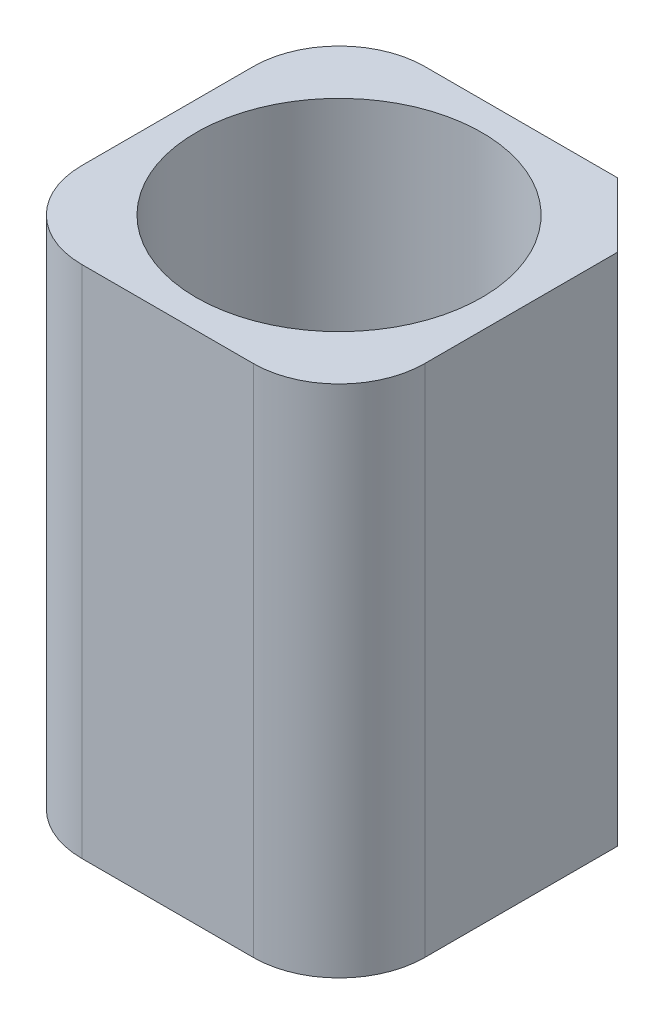
ISO-10303-21;
HEADER;
FILE_DESCRIPTION(('STEP AP214'),'2;1');
FILE_NAME('part.step','',(''),(''),'','','');
FILE_SCHEMA(('AUTOMOTIVE_DESIGN { 1 0 10303 214 1 1 1 1 }'));
ENDSEC;
DATA;
#1=APPLICATION_CONTEXT('core data for automotive mechanical design processes');
#2=APPLICATION_PROTOCOL_DEFINITION('international standard','automotive_design',2000,#1);
#3=PRODUCT_CONTEXT('',#1,'mechanical');
#4=PRODUCT('Part','Part','',(#3));
#5=PRODUCT_RELATED_PRODUCT_CATEGORY('part','',(#4));
#6=PRODUCT_DEFINITION_FORMATION('','',#4);
#7=PRODUCT_DEFINITION_CONTEXT('part definition',#1,'design');
#8=PRODUCT_DEFINITION('design','',#6,#7);
#9=PRODUCT_DEFINITION_SHAPE('','',#8);
#10=(LENGTH_UNIT() NAMED_UNIT(*) SI_UNIT(.MILLI.,.METRE.));
#11=(NAMED_UNIT(*) PLANE_ANGLE_UNIT() SI_UNIT($,.RADIAN.));
#12=(NAMED_UNIT(*) SI_UNIT($,.STERADIAN.) SOLID_ANGLE_UNIT());
#13=UNCERTAINTY_MEASURE_WITH_UNIT(LENGTH_MEASURE(1.E-05),#10,'distance_accuracy_value','');
#14=(GEOMETRIC_REPRESENTATION_CONTEXT(3) GLOBAL_UNCERTAINTY_ASSIGNED_CONTEXT((#13)) GLOBAL_UNIT_ASSIGNED_CONTEXT((#10,
#11,#12)) REPRESENTATION_CONTEXT('',''));
#15=CARTESIAN_POINT('',(0.,0.,0.));
#16=DIRECTION('',(0.,0.,1.));
#17=DIRECTION('',(1.,0.,0.));
#18=AXIS2_PLACEMENT_3D('',#15,#16,#17);
#19=CARTESIAN_POINT('',(1.5,4.5,1.5));
#20=DIRECTION('',(0.,-1.,0.));
#21=DIRECTION('',(0.,0.,-1.));
#22=AXIS2_PLACEMENT_3D('',#19,#20,#21);
#23=CYLINDRICAL_SURFACE('',#22,1.5);
#24=CARTESIAN_POINT('',(1.5,-4.5,1.5));
#25=DIRECTION('',(0.,1.,0.));
#26=DIRECTION('',(0.,0.,1.));
#27=AXIS2_PLACEMENT_3D('',#24,#25,#26);
#28=CIRCLE('',#27,1.5);
#29=CARTESIAN_POINT('',(1.5,-4.5,3.));
#30=VERTEX_POINT('',#29);
#31=CARTESIAN_POINT('',(3.,-4.5,1.5));
#32=VERTEX_POINT('',#31);
#33=EDGE_CURVE('E353',#30,#32,#28,.T.);
#34=ORIENTED_EDGE('',*,*,#33,.T.);
#35=DIRECTION('',(0.,-1.,0.));
#36=VECTOR('',#35,1.);
#37=CARTESIAN_POINT('',(3.,4.5,1.5));
#38=LINE('',#37,#36);
#39=CARTESIAN_POINT('',(3.,4.5,1.5));
#40=VERTEX_POINT('',#39);
#41=EDGE_CURVE('E11',#40,#32,#38,.T.);
#42=ORIENTED_EDGE('',*,*,#41,.F.);
#43=CARTESIAN_POINT('',(1.5,4.5,1.5));
#44=DIRECTION('',(0.,1.,0.));
#45=DIRECTION('',(0.,0.,1.));
#46=AXIS2_PLACEMENT_3D('',#43,#44,#45);
#47=CIRCLE('',#46,1.5);
#48=CARTESIAN_POINT('',(1.5,4.5,3.));
#49=VERTEX_POINT('',#48);
#50=EDGE_CURVE('E320',#49,#40,#47,.T.);
#51=ORIENTED_EDGE('',*,*,#50,.F.);
#52=DIRECTION('',(0.,-1.,0.));
#53=VECTOR('',#52,1.);
#54=CARTESIAN_POINT('',(1.5,4.5,3.));
#55=LINE('',#54,#53);
#56=EDGE_CURVE('E349',#49,#30,#55,.T.);
#57=ORIENTED_EDGE('',*,*,#56,.T.);
#58=EDGE_LOOP('',(#34,#42,#51,#57));
#59=FACE_BOUND('',#58,.T.);
#60=ADVANCED_FACE('F41',(#59),#23,.T.);
#61=CARTESIAN_POINT('',(3.,4.5,0.));
#62=DIRECTION('',(-1.,0.,0.));
#63=DIRECTION('',(0.,0.,1.));
#64=AXIS2_PLACEMENT_3D('',#61,#62,#63);
#65=PLANE('',#64);
#66=DIRECTION('',(0.,0.,-1.));
#67=VECTOR('',#66,1.);
#68=CARTESIAN_POINT('',(3.,-4.5,0.));
#69=LINE('',#68,#67);
#70=CARTESIAN_POINT('',(3.,-4.5,-1.875));
#71=VERTEX_POINT('',#70);
#72=EDGE_CURVE('E357',#32,#71,#69,.T.);
#73=ORIENTED_EDGE('',*,*,#72,.T.);
#74=DIRECTION('',(0.,-1.,0.));
#75=VECTOR('',#74,1.);
#76=CARTESIAN_POINT('',(3.,4.5,-1.875));
#77=LINE('',#76,#75);
#78=CARTESIAN_POINT('',(3.,4.5,-1.875));
#79=VERTEX_POINT('',#78);
#80=EDGE_CURVE('E50',#79,#71,#77,.T.);
#81=ORIENTED_EDGE('',*,*,#80,.F.);
#82=DIRECTION('',(0.,0.,-1.));
#83=VECTOR('',#82,1.);
#84=CARTESIAN_POINT('',(3.,4.5,0.));
#85=LINE('',#84,#83);
#86=EDGE_CURVE('E325',#40,#79,#85,.T.);
#87=ORIENTED_EDGE('',*,*,#86,.F.);
#88=ORIENTED_EDGE('',*,*,#41,.T.);
#89=EDGE_LOOP('',(#73,#81,#87,#88));
#90=FACE_BOUND('',#89,.T.);
#91=ADVANCED_FACE('F407',(#90),#65,.F.);
#92=CARTESIAN_POINT('',(2.4375,4.5,-2.4375));
#93=DIRECTION('',(0.707106781186547,0.,-0.707106781186547));
#94=DIRECTION('',(-0.707106781186548,0.,-0.707106781186548));
#95=AXIS2_PLACEMENT_3D('',#92,#93,#94);
#96=PLANE('',#95);
#97=DIRECTION('',(0.707106781186548,0.,0.707106781186548));
#98=VECTOR('',#97,1.);
#99=CARTESIAN_POINT('',(2.4375,-4.5,-2.4375));
#100=LINE('',#99,#98);
#101=CARTESIAN_POINT('',(1.875,-4.5,-3.));
#102=VERTEX_POINT('',#101);
#103=EDGE_CURVE('E361',#102,#71,#100,.T.);
#104=ORIENTED_EDGE('',*,*,#103,.F.);
#105=DIRECTION('',(0.,-1.,0.));
#106=VECTOR('',#105,1.);
#107=CARTESIAN_POINT('',(1.875,4.5,-3.));
#108=LINE('',#107,#106);
#109=CARTESIAN_POINT('',(1.875,4.5,-3.));
#110=VERTEX_POINT('',#109);
#111=EDGE_CURVE('E398',#110,#102,#108,.T.);
#112=ORIENTED_EDGE('',*,*,#111,.F.);
#113=DIRECTION('',(0.707106781186548,0.,0.707106781186548));
#114=VECTOR('',#113,1.);
#115=CARTESIAN_POINT('',(2.4375,4.5,-2.4375));
#116=LINE('',#115,#114);
#117=EDGE_CURVE('E328',#110,#79,#116,.T.);
#118=ORIENTED_EDGE('',*,*,#117,.T.);
#119=ORIENTED_EDGE('',*,*,#80,.T.);
#120=EDGE_LOOP('',(#104,#112,#118,#119));
#121=FACE_BOUND('',#120,.T.);
#122=ADVANCED_FACE('F404',(#121),#96,.T.);
#123=CARTESIAN_POINT('',(0.,4.5,-3.));
#124=DIRECTION('',(0.,0.,-1.));
#125=DIRECTION('',(-1.,0.,0.));
#126=AXIS2_PLACEMENT_3D('',#123,#124,#125);
#127=PLANE('',#126);
#128=DIRECTION('',(1.,0.,0.));
#129=VECTOR('',#128,1.);
#130=CARTESIAN_POINT('',(0.,-4.5,-3.));
#131=LINE('',#130,#129);
#132=CARTESIAN_POINT('',(-1.5,-4.5,-3.));
#133=VERTEX_POINT('',#132);
#134=EDGE_CURVE('E365',#133,#102,#131,.T.);
#135=ORIENTED_EDGE('',*,*,#134,.F.);
#136=DIRECTION('',(0.,-1.,0.));
#137=VECTOR('',#136,1.);
#138=CARTESIAN_POINT('',(-1.5,4.5,-3.));
#139=LINE('',#138,#137);
#140=CARTESIAN_POINT('',(-1.5,4.5,-3.));
#141=VERTEX_POINT('',#140);
#142=EDGE_CURVE('E395',#141,#133,#139,.T.);
#143=ORIENTED_EDGE('',*,*,#142,.F.);
#144=DIRECTION('',(1.,0.,0.));
#145=VECTOR('',#144,1.);
#146=CARTESIAN_POINT('',(0.,4.5,-3.));
#147=LINE('',#146,#145);
#148=EDGE_CURVE('E332',#141,#110,#147,.T.);
#149=ORIENTED_EDGE('',*,*,#148,.T.);
#150=ORIENTED_EDGE('',*,*,#111,.T.);
#151=EDGE_LOOP('',(#135,#143,#149,#150));
#152=FACE_BOUND('',#151,.T.);
#153=ADVANCED_FACE('F415',(#152),#127,.T.);
#154=CARTESIAN_POINT('',(-1.5,4.5,-1.5));
#155=DIRECTION('',(0.,-1.,0.));
#156=DIRECTION('',(0.,0.,-1.));
#157=AXIS2_PLACEMENT_3D('',#154,#155,#156);
#158=CYLINDRICAL_SURFACE('',#157,1.5);
#159=CARTESIAN_POINT('',(-1.5,-4.5,-1.5));
#160=DIRECTION('',(0.,1.,0.));
#161=DIRECTION('',(0.,0.,1.));
#162=AXIS2_PLACEMENT_3D('',#159,#160,#161);
#163=CIRCLE('',#162,1.5);
#164=CARTESIAN_POINT('',(-3.,-4.5,-1.5));
#165=VERTEX_POINT('',#164);
#166=EDGE_CURVE('E369',#133,#165,#163,.T.);
#167=ORIENTED_EDGE('',*,*,#166,.T.);
#168=DIRECTION('',(0.,-1.,0.));
#169=VECTOR('',#168,1.);
#170=CARTESIAN_POINT('',(-3.,4.5,-1.5));
#171=LINE('',#170,#169);
#172=CARTESIAN_POINT('',(-3.,4.5,-1.5));
#173=VERTEX_POINT('',#172);
#174=EDGE_CURVE('E392',#173,#165,#171,.T.);
#175=ORIENTED_EDGE('',*,*,#174,.F.);
#176=CARTESIAN_POINT('',(-1.5,4.5,-1.5));
#177=DIRECTION('',(0.,1.,0.));
#178=DIRECTION('',(0.,0.,1.));
#179=AXIS2_PLACEMENT_3D('',#176,#177,#178);
#180=CIRCLE('',#179,1.5);
#181=EDGE_CURVE('E336',#141,#173,#180,.T.);
#182=ORIENTED_EDGE('',*,*,#181,.F.);
#183=ORIENTED_EDGE('',*,*,#142,.T.);
#184=EDGE_LOOP('',(#167,#175,#182,#183));
#185=FACE_BOUND('',#184,.T.);
#186=ADVANCED_FACE('F438',(#185),#158,.T.);
#187=CARTESIAN_POINT('',(-3.,4.5,0.));
#188=DIRECTION('',(-1.,0.,0.));
#189=DIRECTION('',(0.,0.,1.));
#190=AXIS2_PLACEMENT_3D('',#187,#188,#189);
#191=PLANE('',#190);
#192=DIRECTION('',(0.,0.,-1.));
#193=VECTOR('',#192,1.);
#194=CARTESIAN_POINT('',(-3.,-4.5,0.));
#195=LINE('',#194,#193);
#196=CARTESIAN_POINT('',(-3.,-4.5,1.5));
#197=VERTEX_POINT('',#196);
#198=EDGE_CURVE('E373',#197,#165,#195,.T.);
#199=ORIENTED_EDGE('',*,*,#198,.F.);
#200=DIRECTION('',(0.,-1.,0.));
#201=VECTOR('',#200,1.);
#202=CARTESIAN_POINT('',(-3.,4.5,1.5));
#203=LINE('',#202,#201);
#204=CARTESIAN_POINT('',(-3.,4.5,1.5));
#205=VERTEX_POINT('',#204);
#206=EDGE_CURVE('E389',#205,#197,#203,.T.);
#207=ORIENTED_EDGE('',*,*,#206,.F.);
#208=DIRECTION('',(0.,0.,-1.));
#209=VECTOR('',#208,1.);
#210=CARTESIAN_POINT('',(-3.,4.5,0.));
#211=LINE('',#210,#209);
#212=EDGE_CURVE('E339',#205,#173,#211,.T.);
#213=ORIENTED_EDGE('',*,*,#212,.T.);
#214=ORIENTED_EDGE('',*,*,#174,.T.);
#215=EDGE_LOOP('',(#199,#207,#213,#214));
#216=FACE_BOUND('',#215,.T.);
#217=ADVANCED_FACE('F435',(#216),#191,.T.);
#218=CARTESIAN_POINT('',(-1.5,4.5,1.5));
#219=DIRECTION('',(0.,-1.,0.));
#220=DIRECTION('',(0.,0.,-1.));
#221=AXIS2_PLACEMENT_3D('',#218,#219,#220);
#222=CYLINDRICAL_SURFACE('',#221,1.5);
#223=CARTESIAN_POINT('',(-1.5,-4.5,1.5));
#224=DIRECTION('',(0.,1.,0.));
#225=DIRECTION('',(0.,0.,1.));
#226=AXIS2_PLACEMENT_3D('',#223,#224,#225);
#227=CIRCLE('',#226,1.5);
#228=CARTESIAN_POINT('',(-1.5,-4.5,3.));
#229=VERTEX_POINT('',#228);
#230=EDGE_CURVE('E377',#197,#229,#227,.T.);
#231=ORIENTED_EDGE('',*,*,#230,.T.);
#232=DIRECTION('',(0.,-1.,0.));
#233=VECTOR('',#232,1.);
#234=CARTESIAN_POINT('',(-1.5,4.5,3.));
#235=LINE('',#234,#233);
#236=CARTESIAN_POINT('',(-1.5,4.5,3.));
#237=VERTEX_POINT('',#236);
#238=EDGE_CURVE('E385',#237,#229,#235,.T.);
#239=ORIENTED_EDGE('',*,*,#238,.F.);
#240=CARTESIAN_POINT('',(-1.5,4.5,1.5));
#241=DIRECTION('',(0.,1.,0.));
#242=DIRECTION('',(0.,0.,1.));
#243=AXIS2_PLACEMENT_3D('',#240,#241,#242);
#244=CIRCLE('',#243,1.5);
#245=EDGE_CURVE('E343',#205,#237,#244,.T.);
#246=ORIENTED_EDGE('',*,*,#245,.F.);
#247=ORIENTED_EDGE('',*,*,#206,.T.);
#248=EDGE_LOOP('',(#231,#239,#246,#247));
#249=FACE_BOUND('',#248,.T.);
#250=ADVANCED_FACE('F432',(#249),#222,.T.);
#251=CARTESIAN_POINT('',(0.,4.5,0.));
#252=DIRECTION('',(0.,-1.,0.));
#253=DIRECTION('',(0.,0.,-1.));
#254=AXIS2_PLACEMENT_3D('',#251,#252,#253);
#255=CYLINDRICAL_SURFACE('',#254,2.5);
#256=CARTESIAN_POINT('',(0.,4.5,0.));
#257=DIRECTION('',(0.,1.,0.));
#258=DIRECTION('',(0.,0.,1.));
#259=AXIS2_PLACEMENT_3D('',#256,#257,#258);
#260=CIRCLE('',#259,2.5);
#261=CARTESIAN_POINT('',(0.,4.5,2.5));
#262=VERTEX_POINT('',#261);
#263=EDGE_CURVE('E316',#262,#262,#260,.T.);
#264=ORIENTED_EDGE('',*,*,#263,.T.);
#265=EDGE_LOOP('',(#264));
#266=FACE_BOUND('',#265,.T.);
#267=CARTESIAN_POINT('',(0.,-4.5,0.));
#268=DIRECTION('',(0.,1.,0.));
#269=DIRECTION('',(0.,0.,1.));
#270=AXIS2_PLACEMENT_3D('',#267,#268,#269);
#271=CIRCLE('',#270,2.5);
#272=CARTESIAN_POINT('',(0.,-4.5,2.5));
#273=VERTEX_POINT('',#272);
#274=EDGE_CURVE('E225',#273,#273,#271,.T.);
#275=ORIENTED_EDGE('',*,*,#274,.F.);
#276=EDGE_LOOP('',(#275));
#277=FACE_BOUND('',#276,.T.);
#278=ADVANCED_FACE('F43',(#266,#277),#255,.F.);
#279=CARTESIAN_POINT('',(0.,4.5,3.));
#280=DIRECTION('',(0.,0.,-1.));
#281=DIRECTION('',(-1.,0.,0.));
#282=AXIS2_PLACEMENT_3D('',#279,#280,#281);
#283=PLANE('',#282);
#284=DIRECTION('',(1.,0.,0.));
#285=VECTOR('',#284,1.);
#286=CARTESIAN_POINT('',(0.,-4.5,3.));
#287=LINE('',#286,#285);
#288=EDGE_CURVE('E321',#229,#30,#287,.T.);
#289=ORIENTED_EDGE('',*,*,#288,.T.);
#290=ORIENTED_EDGE('',*,*,#56,.F.);
#291=DIRECTION('',(1.,0.,0.));
#292=VECTOR('',#291,1.);
#293=CARTESIAN_POINT('',(0.,4.5,3.));
#294=LINE('',#293,#292);
#295=EDGE_CURVE('E346',#237,#49,#294,.T.);
#296=ORIENTED_EDGE('',*,*,#295,.F.);
#297=ORIENTED_EDGE('',*,*,#238,.T.);
#298=EDGE_LOOP('',(#289,#290,#296,#297));
#299=FACE_BOUND('',#298,.T.);
#300=ADVANCED_FACE('F428',(#299),#283,.F.);
#301=CARTESIAN_POINT('',(0.,4.5,0.));
#302=DIRECTION('',(0.,1.,0.));
#303=DIRECTION('',(0.,0.,1.));
#304=AXIS2_PLACEMENT_3D('',#301,#302,#303);
#305=PLANE('',#304);
#306=ORIENTED_EDGE('',*,*,#263,.F.);
#307=EDGE_LOOP('',(#306));
#308=FACE_BOUND('',#307,.T.);
#309=ORIENTED_EDGE('',*,*,#50,.T.);
#310=ORIENTED_EDGE('',*,*,#86,.T.);
#311=ORIENTED_EDGE('',*,*,#117,.F.);
#312=ORIENTED_EDGE('',*,*,#148,.F.);
#313=ORIENTED_EDGE('',*,*,#181,.T.);
#314=ORIENTED_EDGE('',*,*,#212,.F.);
#315=ORIENTED_EDGE('',*,*,#245,.T.);
#316=ORIENTED_EDGE('',*,*,#295,.T.);
#317=EDGE_LOOP('',(#309,#310,#311,#312,#313,#314,#315,#316));
#318=FACE_BOUND('',#317,.T.);
#319=ADVANCED_FACE('F419',(#308,#318),#305,.T.);
#320=CARTESIAN_POINT('',(0.,-4.5,0.));
#321=DIRECTION('',(0.,1.,0.));
#322=DIRECTION('',(0.,0.,1.));
#323=AXIS2_PLACEMENT_3D('',#320,#321,#322);
#324=PLANE('',#323);
#325=DIRECTION('',(-1.,0.,0.));
#326=VECTOR('',#325,1.);
#327=CARTESIAN_POINT('',(-2.5,-4.5,1.75));
#328=LINE('',#327,#326);
#329=CARTESIAN_POINT('',(-2.225,-4.5,1.75));
#330=VERTEX_POINT('',#329);
#331=CARTESIAN_POINT('',(-2.5,-4.5,1.75));
#332=VERTEX_POINT('',#331);
#333=EDGE_CURVE('E215',#330,#332,#328,.T.);
#334=ORIENTED_EDGE('',*,*,#333,.F.);
#335=DIRECTION('',(0.,0.,1.));
#336=VECTOR('',#335,1.);
#337=CARTESIAN_POINT('',(-2.225,-4.5,1.75));
#338=LINE('',#337,#336);
#339=CARTESIAN_POINT('',(-2.225,-4.5,1.475));
#340=VERTEX_POINT('',#339);
#341=EDGE_CURVE('E57',#340,#330,#338,.T.);
#342=ORIENTED_EDGE('',*,*,#341,.F.);
#343=DIRECTION('',(1.,0.,0.));
#344=VECTOR('',#343,1.);
#345=CARTESIAN_POINT('',(-2.5,-4.5,1.475));
#346=LINE('',#345,#344);
#347=CARTESIAN_POINT('',(-2.5,-4.5,1.475));
#348=VERTEX_POINT('',#347);
#349=EDGE_CURVE('E202',#348,#340,#346,.T.);
#350=ORIENTED_EDGE('',*,*,#349,.F.);
#351=DIRECTION('',(0.,0.,-1.));
#352=VECTOR('',#351,1.);
#353=CARTESIAN_POINT('',(-2.5,-4.5,1.75));
#354=LINE('',#353,#352);
#355=EDGE_CURVE('E206',#332,#348,#354,.T.);
#356=ORIENTED_EDGE('',*,*,#355,.F.);
#357=EDGE_LOOP('',(#334,#342,#350,#356));
#358=FACE_BOUND('',#357,.T.);
#359=DIRECTION('',(-1.,0.,0.));
#360=VECTOR('',#359,1.);
#361=CARTESIAN_POINT('',(-2.25,-4.5,-2.225));
#362=LINE('',#361,#360);
#363=CARTESIAN_POINT('',(-1.975,-4.5,-2.225));
#364=VERTEX_POINT('',#363);
#365=CARTESIAN_POINT('',(-2.25,-4.5,-2.225));
#366=VERTEX_POINT('',#365);
#367=EDGE_CURVE('E251',#364,#366,#362,.T.);
#368=ORIENTED_EDGE('',*,*,#367,.F.);
#369=DIRECTION('',(0.,0.,1.));
#370=VECTOR('',#369,1.);
#371=CARTESIAN_POINT('',(-1.975,-4.5,-2.225));
#372=LINE('',#371,#370);
#373=CARTESIAN_POINT('',(-1.975,-4.5,-2.5));
#374=VERTEX_POINT('',#373);
#375=EDGE_CURVE('E65',#374,#364,#372,.T.);
#376=ORIENTED_EDGE('',*,*,#375,.F.);
#377=DIRECTION('',(1.,0.,0.));
#378=VECTOR('',#377,1.);
#379=CARTESIAN_POINT('',(-2.25,-4.5,-2.5));
#380=LINE('',#379,#378);
#381=CARTESIAN_POINT('',(-2.25,-4.5,-2.5));
#382=VERTEX_POINT('',#381);
#383=EDGE_CURVE('E236',#382,#374,#380,.T.);
#384=ORIENTED_EDGE('',*,*,#383,.F.);
#385=DIRECTION('',(0.,0.,-1.));
#386=VECTOR('',#385,1.);
#387=CARTESIAN_POINT('',(-2.25,-4.5,-2.225));
#388=LINE('',#387,#386);
#389=EDGE_CURVE('E256',#366,#382,#388,.T.);
#390=ORIENTED_EDGE('',*,*,#389,.F.);
#391=EDGE_LOOP('',(#368,#376,#384,#390));
#392=FACE_BOUND('',#391,.T.);
#393=DIRECTION('',(-1.,0.,0.));
#394=VECTOR('',#393,1.);
#395=CARTESIAN_POINT('',(1.98,-4.5,-2.225));
#396=LINE('',#395,#394);
#397=CARTESIAN_POINT('',(1.98,-4.5,-2.225));
#398=VERTEX_POINT('',#397);
#399=CARTESIAN_POINT('',(1.705,-4.5,-2.225));
#400=VERTEX_POINT('',#399);
#401=EDGE_CURVE('E294',#398,#400,#396,.T.);
#402=ORIENTED_EDGE('',*,*,#401,.F.);
#403=DIRECTION('',(0.,0.,1.));
#404=VECTOR('',#403,1.);
#405=CARTESIAN_POINT('',(1.98,-4.5,-2.5));
#406=LINE('',#405,#404);
#407=CARTESIAN_POINT('',(1.98,-4.5,-2.5));
#408=VERTEX_POINT('',#407);
#409=EDGE_CURVE('E291',#408,#398,#406,.T.);
#410=ORIENTED_EDGE('',*,*,#409,.F.);
#411=DIRECTION('',(1.,0.,0.));
#412=VECTOR('',#411,1.);
#413=CARTESIAN_POINT('',(1.98,-4.5,-2.5));
#414=LINE('',#413,#412);
#415=CARTESIAN_POINT('',(1.705,-4.5,-2.5));
#416=VERTEX_POINT('',#415);
#417=EDGE_CURVE('E278',#416,#408,#414,.T.);
#418=ORIENTED_EDGE('',*,*,#417,.F.);
#419=DIRECTION('',(0.,0.,-1.));
#420=VECTOR('',#419,1.);
#421=CARTESIAN_POINT('',(1.705,-4.5,-2.5));
#422=LINE('',#421,#420);
#423=EDGE_CURVE('E298',#400,#416,#422,.T.);
#424=ORIENTED_EDGE('',*,*,#423,.F.);
#425=EDGE_LOOP('',(#402,#410,#418,#424));
#426=FACE_BOUND('',#425,.T.);
#427=ORIENTED_EDGE('',*,*,#274,.T.);
#428=EDGE_LOOP('',(#427));
#429=FACE_BOUND('',#428,.T.);
#430=ORIENTED_EDGE('',*,*,#33,.F.);
#431=ORIENTED_EDGE('',*,*,#288,.F.);
#432=ORIENTED_EDGE('',*,*,#230,.F.);
#433=ORIENTED_EDGE('',*,*,#198,.T.);
#434=ORIENTED_EDGE('',*,*,#166,.F.);
#435=ORIENTED_EDGE('',*,*,#134,.T.);
#436=ORIENTED_EDGE('',*,*,#103,.T.);
#437=ORIENTED_EDGE('',*,*,#72,.F.);
#438=EDGE_LOOP('',(#430,#431,#432,#433,#434,#435,#436,#437));
#439=FACE_BOUND('',#438,.T.);
#440=ADVANCED_FACE('F411',(#358,#392,#426,#429,#439),#324,.F.);
#441=CARTESIAN_POINT('',(1.98,-3.5,-2.5));
#442=DIRECTION('',(1.,0.,0.));
#443=DIRECTION('',(0.,0.,-1.));
#444=AXIS2_PLACEMENT_3D('',#441,#442,#443);
#445=PLANE('',#444);
#446=ORIENTED_EDGE('',*,*,#409,.T.);
#447=DIRECTION('',(0.,-1.,0.));
#448=VECTOR('',#447,1.);
#449=CARTESIAN_POINT('',(1.98,-3.5,-2.225));
#450=LINE('',#449,#448);
#451=CARTESIAN_POINT('',(1.98,-3.5,-2.225));
#452=VERTEX_POINT('',#451);
#453=EDGE_CURVE('E290',#452,#398,#450,.T.);
#454=ORIENTED_EDGE('',*,*,#453,.F.);
#455=DIRECTION('',(0.,0.,1.));
#456=VECTOR('',#455,1.);
#457=CARTESIAN_POINT('',(1.98,-3.5,-2.5));
#458=LINE('',#457,#456);
#459=CARTESIAN_POINT('',(1.98,-3.5,-2.5));
#460=VERTEX_POINT('',#459);
#461=EDGE_CURVE('E273',#460,#452,#458,.T.);
#462=ORIENTED_EDGE('',*,*,#461,.F.);
#463=DIRECTION('',(0.,-1.,0.));
#464=VECTOR('',#463,1.);
#465=CARTESIAN_POINT('',(1.98,-3.5,-2.5));
#466=LINE('',#465,#464);
#467=EDGE_CURVE('E252',#460,#408,#466,.T.);
#468=ORIENTED_EDGE('',*,*,#467,.T.);
#469=EDGE_LOOP('',(#446,#454,#462,#468));
#470=FACE_BOUND('',#469,.T.);
#471=ADVANCED_FACE('F517',(#470),#445,.F.);
#472=CARTESIAN_POINT('',(1.98,-3.5,-2.5));
#473=DIRECTION('',(0.,0.,-1.));
#474=DIRECTION('',(-1.,0.,0.));
#475=AXIS2_PLACEMENT_3D('',#472,#473,#474);
#476=PLANE('',#475);
#477=ORIENTED_EDGE('',*,*,#417,.T.);
#478=ORIENTED_EDGE('',*,*,#467,.F.);
#479=DIRECTION('',(1.,0.,0.));
#480=VECTOR('',#479,1.);
#481=CARTESIAN_POINT('',(1.98,-3.5,-2.5));
#482=LINE('',#481,#480);
#483=CARTESIAN_POINT('',(1.705,-3.5,-2.5));
#484=VERTEX_POINT('',#483);
#485=EDGE_CURVE('E286',#484,#460,#482,.T.);
#486=ORIENTED_EDGE('',*,*,#485,.F.);
#487=DIRECTION('',(0.,-1.,0.));
#488=VECTOR('',#487,1.);
#489=CARTESIAN_POINT('',(1.705,-3.5,-2.5));
#490=LINE('',#489,#488);
#491=EDGE_CURVE('E307',#484,#416,#490,.T.);
#492=ORIENTED_EDGE('',*,*,#491,.T.);
#493=EDGE_LOOP('',(#477,#478,#486,#492));
#494=FACE_BOUND('',#493,.T.);
#495=ADVANCED_FACE('F528',(#494),#476,.F.);
#496=CARTESIAN_POINT('',(1.705,-3.5,-2.5));
#497=DIRECTION('',(-1.,0.,0.));
#498=DIRECTION('',(0.,0.,1.));
#499=AXIS2_PLACEMENT_3D('',#496,#497,#498);
#500=PLANE('',#499);
#501=ORIENTED_EDGE('',*,*,#423,.T.);
#502=ORIENTED_EDGE('',*,*,#491,.F.);
#503=DIRECTION('',(0.,0.,-1.));
#504=VECTOR('',#503,1.);
#505=CARTESIAN_POINT('',(1.705,-3.5,-2.5));
#506=LINE('',#505,#504);
#507=CARTESIAN_POINT('',(1.705,-3.5,-2.225));
#508=VERTEX_POINT('',#507);
#509=EDGE_CURVE('E282',#508,#484,#506,.T.);
#510=ORIENTED_EDGE('',*,*,#509,.F.);
#511=DIRECTION('',(0.,-1.,0.));
#512=VECTOR('',#511,1.);
#513=CARTESIAN_POINT('',(1.705,-3.5,-2.225));
#514=LINE('',#513,#512);
#515=EDGE_CURVE('E310',#508,#400,#514,.T.);
#516=ORIENTED_EDGE('',*,*,#515,.T.);
#517=EDGE_LOOP('',(#501,#502,#510,#516));
#518=FACE_BOUND('',#517,.T.);
#519=ADVANCED_FACE('F538',(#518),#500,.F.);
#520=CARTESIAN_POINT('',(1.98,-3.5,-2.225));
#521=DIRECTION('',(0.,0.,1.));
#522=DIRECTION('',(1.,0.,0.));
#523=AXIS2_PLACEMENT_3D('',#520,#521,#522);
#524=PLANE('',#523);
#525=ORIENTED_EDGE('',*,*,#401,.T.);
#526=ORIENTED_EDGE('',*,*,#515,.F.);
#527=DIRECTION('',(-1.,0.,0.));
#528=VECTOR('',#527,1.);
#529=CARTESIAN_POINT('',(1.98,-3.5,-2.225));
#530=LINE('',#529,#528);
#531=EDGE_CURVE('E277',#452,#508,#530,.T.);
#532=ORIENTED_EDGE('',*,*,#531,.F.);
#533=ORIENTED_EDGE('',*,*,#453,.T.);
#534=EDGE_LOOP('',(#525,#526,#532,#533));
#535=FACE_BOUND('',#534,.T.);
#536=ADVANCED_FACE('F548',(#535),#524,.F.);
#537=CARTESIAN_POINT('',(0.,-3.5,0.));
#538=DIRECTION('',(0.,-1.,0.));
#539=DIRECTION('',(0.,0.,-1.));
#540=AXIS2_PLACEMENT_3D('',#537,#538,#539);
#541=PLANE('',#540);
#542=ORIENTED_EDGE('',*,*,#461,.T.);
#543=ORIENTED_EDGE('',*,*,#531,.T.);
#544=ORIENTED_EDGE('',*,*,#509,.T.);
#545=ORIENTED_EDGE('',*,*,#485,.T.);
#546=EDGE_LOOP('',(#542,#543,#544,#545));
#547=FACE_BOUND('',#546,.T.);
#548=ADVANCED_FACE('F558',(#547),#541,.T.);
#549=CARTESIAN_POINT('',(-1.975,-3.5,-2.225));
#550=DIRECTION('',(1.,0.,0.));
#551=DIRECTION('',(0.,0.,-1.));
#552=AXIS2_PLACEMENT_3D('',#549,#550,#551);
#553=PLANE('',#552);
#554=ORIENTED_EDGE('',*,*,#375,.T.);
#555=DIRECTION('',(0.,-1.,0.));
#556=VECTOR('',#555,1.);
#557=CARTESIAN_POINT('',(-1.975,-3.5,-2.225));
#558=LINE('',#557,#556);
#559=CARTESIAN_POINT('',(-1.975,-3.5,-2.225));
#560=VERTEX_POINT('',#559);
#561=EDGE_CURVE('E248',#560,#364,#558,.T.);
#562=ORIENTED_EDGE('',*,*,#561,.F.);
#563=DIRECTION('',(0.,0.,1.));
#564=VECTOR('',#563,1.);
#565=CARTESIAN_POINT('',(-1.975,-3.5,-2.225));
#566=LINE('',#565,#564);
#567=CARTESIAN_POINT('',(-1.975,-3.5,-2.5));
#568=VERTEX_POINT('',#567);
#569=EDGE_CURVE('E231',#568,#560,#566,.T.);
#570=ORIENTED_EDGE('',*,*,#569,.F.);
#571=DIRECTION('',(0.,-1.,0.));
#572=VECTOR('',#571,1.);
#573=CARTESIAN_POINT('',(-1.975,-3.5,-2.5));
#574=LINE('',#573,#572);
#575=EDGE_CURVE('E216',#568,#374,#574,.T.);
#576=ORIENTED_EDGE('',*,*,#575,.T.);
#577=EDGE_LOOP('',(#554,#562,#570,#576));
#578=FACE_BOUND('',#577,.T.);
#579=ADVANCED_FACE('F568',(#578),#553,.F.);
#580=CARTESIAN_POINT('',(-2.25,-3.5,-2.5));
#581=DIRECTION('',(0.,0.,-1.));
#582=DIRECTION('',(-1.,0.,0.));
#583=AXIS2_PLACEMENT_3D('',#580,#581,#582);
#584=PLANE('',#583);
#585=ORIENTED_EDGE('',*,*,#383,.T.);
#586=ORIENTED_EDGE('',*,*,#575,.F.);
#587=DIRECTION('',(1.,0.,0.));
#588=VECTOR('',#587,1.);
#589=CARTESIAN_POINT('',(-2.25,-3.5,-2.5));
#590=LINE('',#589,#588);
#591=CARTESIAN_POINT('',(-2.25,-3.5,-2.5));
#592=VERTEX_POINT('',#591);
#593=EDGE_CURVE('E244',#592,#568,#590,.T.);
#594=ORIENTED_EDGE('',*,*,#593,.F.);
#595=DIRECTION('',(0.,-1.,0.));
#596=VECTOR('',#595,1.);
#597=CARTESIAN_POINT('',(-2.25,-3.5,-2.5));
#598=LINE('',#597,#596);
#599=EDGE_CURVE('E265',#592,#382,#598,.T.);
#600=ORIENTED_EDGE('',*,*,#599,.T.);
#601=EDGE_LOOP('',(#585,#586,#594,#600));
#602=FACE_BOUND('',#601,.T.);
#603=ADVANCED_FACE('F578',(#602),#584,.F.);
#604=CARTESIAN_POINT('',(-2.25,-3.5,-2.225));
#605=DIRECTION('',(-1.,0.,0.));
#606=DIRECTION('',(0.,0.,1.));
#607=AXIS2_PLACEMENT_3D('',#604,#605,#606);
#608=PLANE('',#607);
#609=ORIENTED_EDGE('',*,*,#389,.T.);
#610=ORIENTED_EDGE('',*,*,#599,.F.);
#611=DIRECTION('',(0.,0.,-1.));
#612=VECTOR('',#611,1.);
#613=CARTESIAN_POINT('',(-2.25,-3.5,-2.225));
#614=LINE('',#613,#612);
#615=CARTESIAN_POINT('',(-2.25,-3.5,-2.225));
#616=VERTEX_POINT('',#615);
#617=EDGE_CURVE('E240',#616,#592,#614,.T.);
#618=ORIENTED_EDGE('',*,*,#617,.F.);
#619=DIRECTION('',(0.,-1.,0.));
#620=VECTOR('',#619,1.);
#621=CARTESIAN_POINT('',(-2.25,-3.5,-2.225));
#622=LINE('',#621,#620);
#623=EDGE_CURVE('E268',#616,#366,#622,.T.);
#624=ORIENTED_EDGE('',*,*,#623,.T.);
#625=EDGE_LOOP('',(#609,#610,#618,#624));
#626=FACE_BOUND('',#625,.T.);
#627=ADVANCED_FACE('F587',(#626),#608,.F.);
#628=CARTESIAN_POINT('',(-2.25,-3.5,-2.225));
#629=DIRECTION('',(0.,0.,1.));
#630=DIRECTION('',(1.,0.,0.));
#631=AXIS2_PLACEMENT_3D('',#628,#629,#630);
#632=PLANE('',#631);
#633=ORIENTED_EDGE('',*,*,#367,.T.);
#634=ORIENTED_EDGE('',*,*,#623,.F.);
#635=DIRECTION('',(-1.,0.,0.));
#636=VECTOR('',#635,1.);
#637=CARTESIAN_POINT('',(-2.25,-3.5,-2.225));
#638=LINE('',#637,#636);
#639=EDGE_CURVE('E235',#560,#616,#638,.T.);
#640=ORIENTED_EDGE('',*,*,#639,.F.);
#641=ORIENTED_EDGE('',*,*,#561,.T.);
#642=EDGE_LOOP('',(#633,#634,#640,#641));
#643=FACE_BOUND('',#642,.T.);
#644=ADVANCED_FACE('F597',(#643),#632,.F.);
#645=CARTESIAN_POINT('',(0.,-3.5,0.));
#646=DIRECTION('',(0.,-1.,0.));
#647=DIRECTION('',(0.,0.,-1.));
#648=AXIS2_PLACEMENT_3D('',#645,#646,#647);
#649=PLANE('',#648);
#650=ORIENTED_EDGE('',*,*,#569,.T.);
#651=ORIENTED_EDGE('',*,*,#639,.T.);
#652=ORIENTED_EDGE('',*,*,#617,.T.);
#653=ORIENTED_EDGE('',*,*,#593,.T.);
#654=EDGE_LOOP('',(#650,#651,#652,#653));
#655=FACE_BOUND('',#654,.T.);
#656=ADVANCED_FACE('F607',(#655),#649,.T.);
#657=CARTESIAN_POINT('',(-2.225,-3.5,1.75));
#658=DIRECTION('',(1.,0.,0.));
#659=DIRECTION('',(0.,0.,-1.));
#660=AXIS2_PLACEMENT_3D('',#657,#658,#659);
#661=PLANE('',#660);
#662=ORIENTED_EDGE('',*,*,#341,.T.);
#663=DIRECTION('',(0.,-1.,0.));
#664=VECTOR('',#663,1.);
#665=CARTESIAN_POINT('',(-2.225,-3.5,1.75));
#666=LINE('',#665,#664);
#667=CARTESIAN_POINT('',(-2.225,-3.5,1.75));
#668=VERTEX_POINT('',#667);
#669=EDGE_CURVE('E177',#668,#330,#666,.T.);
#670=ORIENTED_EDGE('',*,*,#669,.F.);
#671=DIRECTION('',(0.,0.,1.));
#672=VECTOR('',#671,1.);
#673=CARTESIAN_POINT('',(-2.225,-3.5,1.75));
#674=LINE('',#673,#672);
#675=CARTESIAN_POINT('',(-2.225,-3.5,1.475));
#676=VERTEX_POINT('',#675);
#677=EDGE_CURVE('E181',#676,#668,#674,.T.);
#678=ORIENTED_EDGE('',*,*,#677,.F.);
#679=DIRECTION('',(0.,-1.,0.));
#680=VECTOR('',#679,1.);
#681=CARTESIAN_POINT('',(-2.225,-3.5,1.475));
#682=LINE('',#681,#680);
#683=EDGE_CURVE('E222',#676,#340,#682,.T.);
#684=ORIENTED_EDGE('',*,*,#683,.T.);
#685=EDGE_LOOP('',(#662,#670,#678,#684));
#686=FACE_BOUND('',#685,.T.);
#687=ADVANCED_FACE('F179',(#686),#661,.F.);
#688=CARTESIAN_POINT('',(-2.5,-3.5,1.475));
#689=DIRECTION('',(0.,0.,-1.));
#690=DIRECTION('',(-1.,0.,0.));
#691=AXIS2_PLACEMENT_3D('',#688,#689,#690);
#692=PLANE('',#691);
#693=ORIENTED_EDGE('',*,*,#349,.T.);
#694=ORIENTED_EDGE('',*,*,#683,.F.);
#695=DIRECTION('',(1.,0.,0.));
#696=VECTOR('',#695,1.);
#697=CARTESIAN_POINT('',(-2.5,-3.5,1.475));
#698=LINE('',#697,#696);
#699=CARTESIAN_POINT('',(-2.5,-3.5,1.475));
#700=VERTEX_POINT('',#699);
#701=EDGE_CURVE('E188',#700,#676,#698,.T.);
#702=ORIENTED_EDGE('',*,*,#701,.F.);
#703=DIRECTION('',(0.,-1.,0.));
#704=VECTOR('',#703,1.);
#705=CARTESIAN_POINT('',(-2.5,-3.5,1.475));
#706=LINE('',#705,#704);
#707=EDGE_CURVE('E226',#700,#348,#706,.T.);
#708=ORIENTED_EDGE('',*,*,#707,.T.);
#709=EDGE_LOOP('',(#693,#694,#702,#708));
#710=FACE_BOUND('',#709,.T.);
#711=ADVANCED_FACE('F626',(#710),#692,.F.);
#712=CARTESIAN_POINT('',(-2.5,-3.5,1.75));
#713=DIRECTION('',(-1.,0.,0.));
#714=DIRECTION('',(0.,0.,1.));
#715=AXIS2_PLACEMENT_3D('',#712,#713,#714);
#716=PLANE('',#715);
#717=ORIENTED_EDGE('',*,*,#355,.T.);
#718=ORIENTED_EDGE('',*,*,#707,.F.);
#719=DIRECTION('',(0.,0.,-1.));
#720=VECTOR('',#719,1.);
#721=CARTESIAN_POINT('',(-2.5,-3.5,1.75));
#722=LINE('',#721,#720);
#723=CARTESIAN_POINT('',(-2.5,-3.5,1.75));
#724=VERTEX_POINT('',#723);
#725=EDGE_CURVE('E197',#724,#700,#722,.T.);
#726=ORIENTED_EDGE('',*,*,#725,.F.);
#727=DIRECTION('',(0.,-1.,0.));
#728=VECTOR('',#727,1.);
#729=CARTESIAN_POINT('',(-2.5,-3.5,1.75));
#730=LINE('',#729,#728);
#731=EDGE_CURVE('E187',#724,#332,#730,.T.);
#732=ORIENTED_EDGE('',*,*,#731,.T.);
#733=EDGE_LOOP('',(#717,#718,#726,#732));
#734=FACE_BOUND('',#733,.T.);
#735=ADVANCED_FACE('F635',(#734),#716,.F.);
#736=CARTESIAN_POINT('',(-2.5,-3.5,1.75));
#737=DIRECTION('',(0.,0.,1.));
#738=DIRECTION('',(1.,0.,0.));
#739=AXIS2_PLACEMENT_3D('',#736,#737,#738);
#740=PLANE('',#739);
#741=ORIENTED_EDGE('',*,*,#333,.T.);
#742=ORIENTED_EDGE('',*,*,#731,.F.);
#743=DIRECTION('',(-1.,0.,0.));
#744=VECTOR('',#743,1.);
#745=CARTESIAN_POINT('',(-2.5,-3.5,1.75));
#746=LINE('',#745,#744);
#747=EDGE_CURVE('E191',#668,#724,#746,.T.);
#748=ORIENTED_EDGE('',*,*,#747,.F.);
#749=ORIENTED_EDGE('',*,*,#669,.T.);
#750=EDGE_LOOP('',(#741,#742,#748,#749));
#751=FACE_BOUND('',#750,.T.);
#752=ADVANCED_FACE('F192',(#751),#740,.F.);
#753=CARTESIAN_POINT('',(0.,-3.5,0.));
#754=DIRECTION('',(0.,-1.,0.));
#755=DIRECTION('',(0.,0.,-1.));
#756=AXIS2_PLACEMENT_3D('',#753,#754,#755);
#757=PLANE('',#756);
#758=ORIENTED_EDGE('',*,*,#677,.T.);
#759=ORIENTED_EDGE('',*,*,#747,.T.);
#760=ORIENTED_EDGE('',*,*,#725,.T.);
#761=ORIENTED_EDGE('',*,*,#701,.T.);
#762=EDGE_LOOP('',(#758,#759,#760,#761));
#763=FACE_BOUND('',#762,.T.);
#764=ADVANCED_FACE('F199',(#763),#757,.T.);
#765=CLOSED_SHELL('',(#60,#91,#122,#153,#186,#217,#250,#278,#300,#319,#440,#471,#495,#519,#536,
#548,#579,#603,#627,#644,#656,#687,#711,#735,#752,#764));
#766=MANIFOLD_SOLID_BREP('B2',#765);
#767=ADVANCED_BREP_SHAPE_REPRESENTATION('',(#18,#766),#14);
#768=SHAPE_DEFINITION_REPRESENTATION(#9,#767);
ENDSEC;
END-ISO-10303-21;
